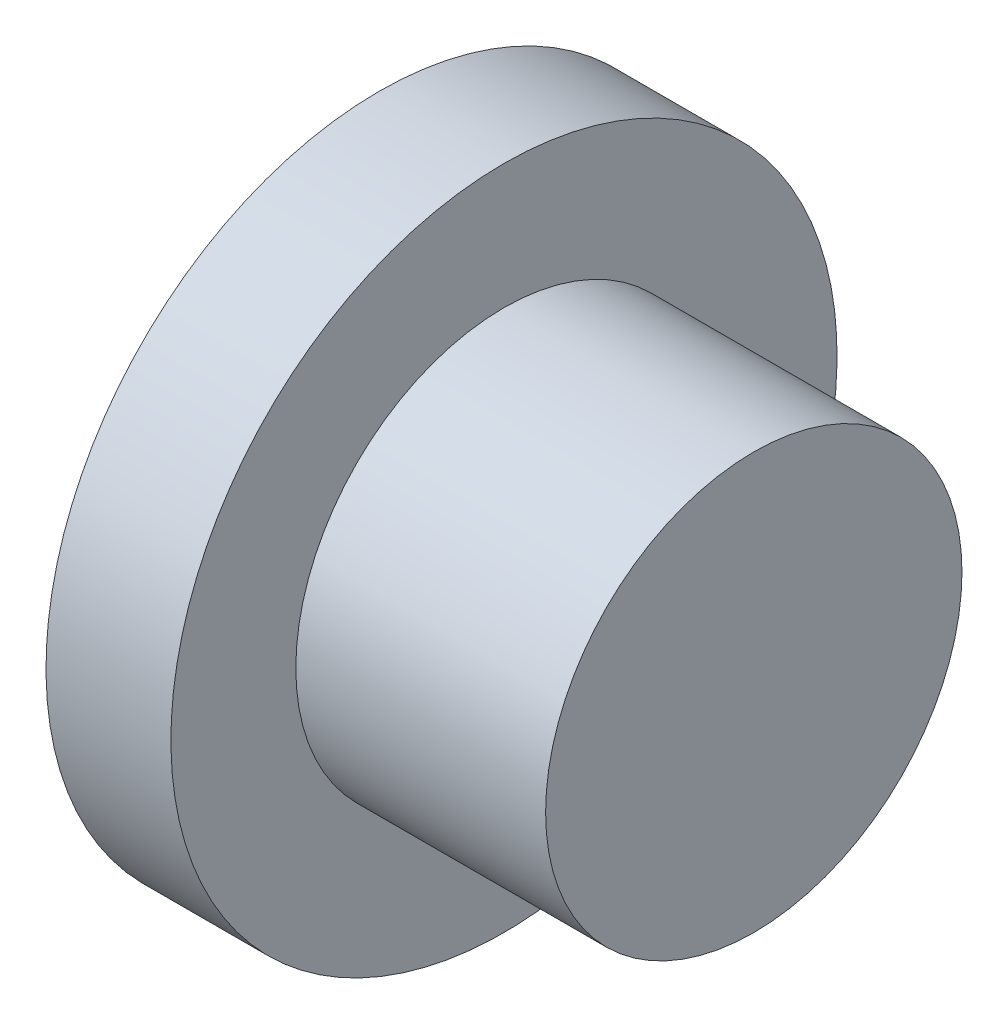
ISO-10303-21;
HEADER;
FILE_DESCRIPTION(('STEP AP214'),'2;1');
FILE_NAME('part.step','',(''),(''),'','','');
FILE_SCHEMA(('AUTOMOTIVE_DESIGN { 1 0 10303 214 1 1 1 1 }'));
ENDSEC;
DATA;
#1=APPLICATION_CONTEXT('core data for automotive mechanical design processes');
#2=APPLICATION_PROTOCOL_DEFINITION('international standard','automotive_design',2000,#1);
#3=PRODUCT_CONTEXT('',#1,'mechanical');
#4=PRODUCT('Part','Part','',(#3));
#5=PRODUCT_RELATED_PRODUCT_CATEGORY('part','',(#4));
#6=PRODUCT_DEFINITION_FORMATION('','',#4);
#7=PRODUCT_DEFINITION_CONTEXT('part definition',#1,'design');
#8=PRODUCT_DEFINITION('design','',#6,#7);
#9=PRODUCT_DEFINITION_SHAPE('','',#8);
#10=(LENGTH_UNIT() NAMED_UNIT(*) SI_UNIT(.MILLI.,.METRE.));
#11=(NAMED_UNIT(*) PLANE_ANGLE_UNIT() SI_UNIT($,.RADIAN.));
#12=(NAMED_UNIT(*) SI_UNIT($,.STERADIAN.) SOLID_ANGLE_UNIT());
#13=UNCERTAINTY_MEASURE_WITH_UNIT(LENGTH_MEASURE(1.E-05),#10,'distance_accuracy_value','');
#14=(GEOMETRIC_REPRESENTATION_CONTEXT(3) GLOBAL_UNCERTAINTY_ASSIGNED_CONTEXT((#13)) GLOBAL_UNIT_ASSIGNED_CONTEXT((#10,
#11,#12)) REPRESENTATION_CONTEXT('',''));
#15=CARTESIAN_POINT('',(0.,0.,0.));
#16=DIRECTION('',(0.,0.,1.));
#17=DIRECTION('',(1.,0.,0.));
#18=AXIS2_PLACEMENT_3D('',#15,#16,#17);
#19=CARTESIAN_POINT('',(0.,0.,0.));
#20=DIRECTION('',(-1.,0.,0.));
#21=DIRECTION('',(0.,-1.,0.));
#22=AXIS2_PLACEMENT_3D('',#19,#20,#21);
#23=PLANE('',#22);
#24=CARTESIAN_POINT('',(0.,0.,0.));
#25=DIRECTION('',(1.,0.,0.));
#26=DIRECTION('',(0.,1.,0.));
#27=AXIS2_PLACEMENT_3D('',#24,#25,#26);
#28=CIRCLE('',#27,4.);
#29=CARTESIAN_POINT('',(0.,4.,0.));
#30=VERTEX_POINT('',#29);
#31=EDGE_CURVE('E10',#30,#30,#28,.T.);
#32=ORIENTED_EDGE('',*,*,#31,.F.);
#33=EDGE_LOOP('',(#32));
#34=FACE_BOUND('',#33,.T.);
#35=ADVANCED_FACE('F31',(#34),#23,.T.);
#36=CARTESIAN_POINT('',(4.5,0.,0.));
#37=DIRECTION('',(1.,0.,0.));
#38=DIRECTION('',(0.,1.,0.));
#39=AXIS2_PLACEMENT_3D('',#36,#37,#38);
#40=CYLINDRICAL_SURFACE('',#39,4.);
#41=ORIENTED_EDGE('',*,*,#31,.T.);
#42=EDGE_LOOP('',(#41));
#43=FACE_BOUND('',#42,.T.);
#44=CARTESIAN_POINT('',(1.5,0.,0.));
#45=DIRECTION('',(1.,0.,0.));
#46=DIRECTION('',(0.,1.,0.));
#47=AXIS2_PLACEMENT_3D('',#44,#45,#46);
#48=CIRCLE('',#47,4.);
#49=CARTESIAN_POINT('',(1.5,4.,0.));
#50=VERTEX_POINT('',#49);
#51=EDGE_CURVE('E37',#50,#50,#48,.T.);
#52=ORIENTED_EDGE('',*,*,#51,.F.);
#53=EDGE_LOOP('',(#52));
#54=FACE_BOUND('',#53,.T.);
#55=ADVANCED_FACE('F63',(#43,#54),#40,.T.);
#56=CARTESIAN_POINT('',(1.5,4.,0.));
#57=DIRECTION('',(1.,0.,0.));
#58=DIRECTION('',(0.,1.,0.));
#59=AXIS2_PLACEMENT_3D('',#56,#57,#58);
#60=PLANE('',#59);
#61=ORIENTED_EDGE('',*,*,#51,.T.);
#62=EDGE_LOOP('',(#61));
#63=FACE_BOUND('',#62,.T.);
#64=CARTESIAN_POINT('',(1.5,0.,0.));
#65=DIRECTION('',(1.,0.,0.));
#66=DIRECTION('',(0.,1.,0.));
#67=AXIS2_PLACEMENT_3D('',#64,#65,#66);
#68=CIRCLE('',#67,2.5);
#69=CARTESIAN_POINT('',(1.5,2.5,0.));
#70=VERTEX_POINT('',#69);
#71=EDGE_CURVE('E41',#70,#70,#68,.T.);
#72=ORIENTED_EDGE('',*,*,#71,.F.);
#73=EDGE_LOOP('',(#72));
#74=FACE_BOUND('',#73,.T.);
#75=ADVANCED_FACE('F55',(#63,#74),#60,.T.);
#76=CARTESIAN_POINT('',(4.5,0.,0.));
#77=DIRECTION('',(1.,0.,0.));
#78=DIRECTION('',(0.,1.,0.));
#79=AXIS2_PLACEMENT_3D('',#76,#77,#78);
#80=CYLINDRICAL_SURFACE('',#79,2.5);
#81=ORIENTED_EDGE('',*,*,#71,.T.);
#82=EDGE_LOOP('',(#81));
#83=FACE_BOUND('',#82,.T.);
#84=CARTESIAN_POINT('',(4.5,0.,0.));
#85=DIRECTION('',(1.,0.,0.));
#86=DIRECTION('',(0.,1.,0.));
#87=AXIS2_PLACEMENT_3D('',#84,#85,#86);
#88=CIRCLE('',#87,2.5);
#89=CARTESIAN_POINT('',(4.5,2.5,0.));
#90=VERTEX_POINT('',#89);
#91=EDGE_CURVE('E45',#90,#90,#88,.T.);
#92=ORIENTED_EDGE('',*,*,#91,.F.);
#93=EDGE_LOOP('',(#92));
#94=FACE_BOUND('',#93,.T.);
#95=ADVANCED_FACE('F53',(#83,#94),#80,.T.);
#96=CARTESIAN_POINT('',(4.5,2.5,0.));
#97=DIRECTION('',(1.,0.,0.));
#98=DIRECTION('',(0.,1.,0.));
#99=AXIS2_PLACEMENT_3D('',#96,#97,#98);
#100=PLANE('',#99);
#101=ORIENTED_EDGE('',*,*,#91,.T.);
#102=EDGE_LOOP('',(#101));
#103=FACE_BOUND('',#102,.T.);
#104=ADVANCED_FACE('F51',(#103),#100,.T.);
#105=CLOSED_SHELL('',(#35,#55,#75,#95,#104));
#106=MANIFOLD_SOLID_BREP('B2',#105);
#107=ADVANCED_BREP_SHAPE_REPRESENTATION('',(#18,#106),#14);
#108=SHAPE_DEFINITION_REPRESENTATION(#9,#107);
ENDSEC;
END-ISO-10303-21;
